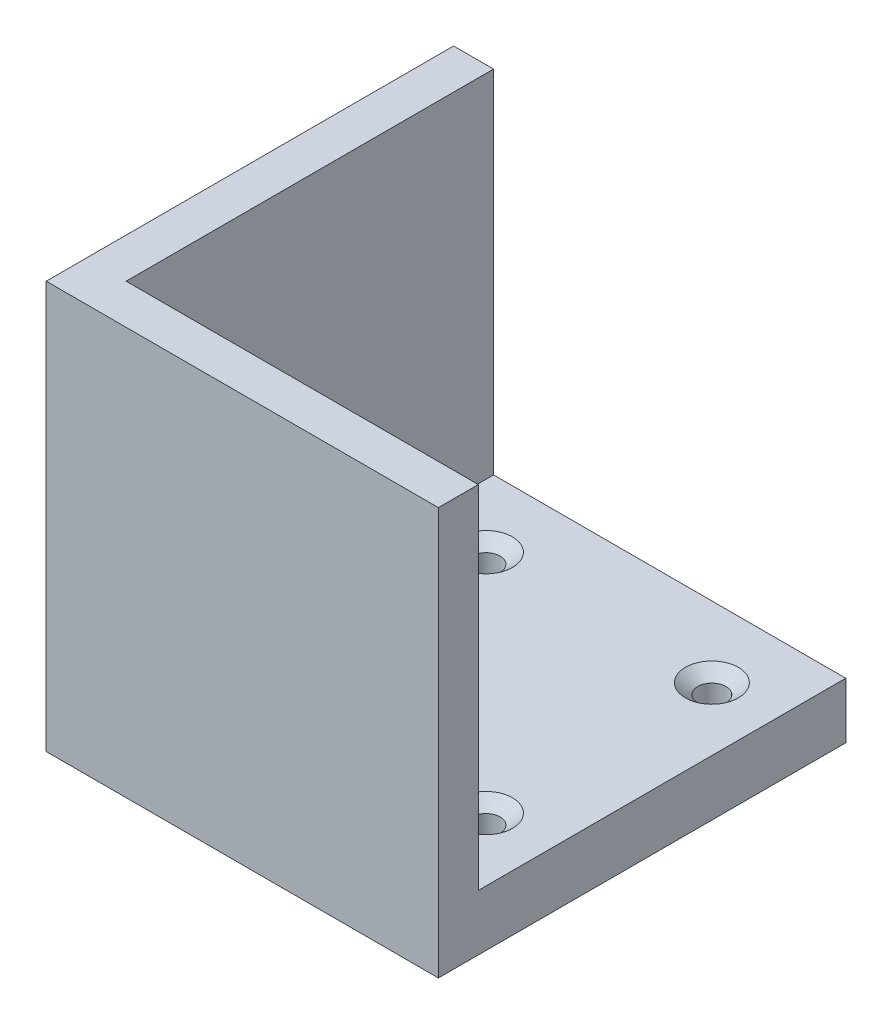
ISO-10303-21;
HEADER;
FILE_DESCRIPTION(('STEP AP214'),'2;1');
FILE_NAME('part.step','',(''),(''),'','','');
FILE_SCHEMA(('AUTOMOTIVE_DESIGN { 1 0 10303 214 1 1 1 1 }'));
ENDSEC;
DATA;
#1=APPLICATION_CONTEXT('core data for automotive mechanical design processes');
#2=APPLICATION_PROTOCOL_DEFINITION('international standard','automotive_design',2000,#1);
#3=PRODUCT_CONTEXT('',#1,'mechanical');
#4=PRODUCT('Part','Part','',(#3));
#5=PRODUCT_RELATED_PRODUCT_CATEGORY('part','',(#4));
#6=PRODUCT_DEFINITION_FORMATION('','',#4);
#7=PRODUCT_DEFINITION_CONTEXT('part definition',#1,'design');
#8=PRODUCT_DEFINITION('design','',#6,#7);
#9=PRODUCT_DEFINITION_SHAPE('','',#8);
#10=(LENGTH_UNIT() NAMED_UNIT(*) SI_UNIT(.MILLI.,.METRE.));
#11=(NAMED_UNIT(*) PLANE_ANGLE_UNIT() SI_UNIT($,.RADIAN.));
#12=(NAMED_UNIT(*) SI_UNIT($,.STERADIAN.) SOLID_ANGLE_UNIT());
#13=UNCERTAINTY_MEASURE_WITH_UNIT(LENGTH_MEASURE(1.E-05),#10,'distance_accuracy_value','');
#14=(GEOMETRIC_REPRESENTATION_CONTEXT(3) GLOBAL_UNCERTAINTY_ASSIGNED_CONTEXT((#13)) GLOBAL_UNIT_ASSIGNED_CONTEXT((#10,
#11,#12)) REPRESENTATION_CONTEXT('',''));
#15=CARTESIAN_POINT('',(0.,0.,0.));
#16=DIRECTION('',(0.,0.,1.));
#17=DIRECTION('',(1.,0.,0.));
#18=AXIS2_PLACEMENT_3D('',#15,#16,#17);
#19=CARTESIAN_POINT('',(28.,8.89,29.21));
#20=DIRECTION('',(-1.,0.,0.));
#21=DIRECTION('',(0.,0.,1.));
#22=AXIS2_PLACEMENT_3D('',#19,#20,#21);
#23=PLANE('',#22);
#24=DIRECTION('',(0.,0.,-1.));
#25=VECTOR('',#24,1.);
#26=CARTESIAN_POINT('',(28.,0.,29.21));
#27=LINE('',#26,#25);
#28=CARTESIAN_POINT('',(28.,0.,35.56));
#29=VERTEX_POINT('',#28);
#30=CARTESIAN_POINT('',(28.,0.,-29.21));
#31=VERTEX_POINT('',#30);
#32=EDGE_CURVE('E121',#29,#31,#27,.T.);
#33=ORIENTED_EDGE('',*,*,#32,.T.);
#34=DIRECTION('',(0.,-1.,0.));
#35=VECTOR('',#34,1.);
#36=CARTESIAN_POINT('',(28.,8.89,-29.21));
#37=LINE('',#36,#35);
#38=CARTESIAN_POINT('',(28.,8.89,-29.21));
#39=VERTEX_POINT('',#38);
#40=EDGE_CURVE('E11',#39,#31,#37,.T.);
#41=ORIENTED_EDGE('',*,*,#40,.F.);
#42=DIRECTION('',(0.,0.,-1.));
#43=VECTOR('',#42,1.);
#44=CARTESIAN_POINT('',(28.,8.89,29.21));
#45=LINE('',#44,#43);
#46=CARTESIAN_POINT('',(28.,8.89,29.21));
#47=VERTEX_POINT('',#46);
#48=EDGE_CURVE('E131',#47,#39,#45,.T.);
#49=ORIENTED_EDGE('',*,*,#48,.F.);
#50=DIRECTION('',(0.,-1.,0.));
#51=VECTOR('',#50,1.);
#52=CARTESIAN_POINT('',(28.,64.77,29.21));
#53=LINE('',#52,#51);
#54=CARTESIAN_POINT('',(28.,64.77,29.21));
#55=VERTEX_POINT('',#54);
#56=EDGE_CURVE('E153',#55,#47,#53,.T.);
#57=ORIENTED_EDGE('',*,*,#56,.F.);
#58=DIRECTION('',(0.,0.,-1.));
#59=VECTOR('',#58,1.);
#60=CARTESIAN_POINT('',(28.,64.77,29.21));
#61=LINE('',#60,#59);
#62=CARTESIAN_POINT('',(28.,64.77,35.56));
#63=VERTEX_POINT('',#62);
#64=EDGE_CURVE('E169',#63,#55,#61,.T.);
#65=ORIENTED_EDGE('',*,*,#64,.F.);
#66=DIRECTION('',(0.,-1.,0.));
#67=VECTOR('',#66,1.);
#68=CARTESIAN_POINT('',(28.,64.77,35.56));
#69=LINE('',#68,#67);
#70=EDGE_CURVE('E127',#63,#29,#69,.T.);
#71=ORIENTED_EDGE('',*,*,#70,.T.);
#72=EDGE_LOOP('',(#33,#41,#49,#57,#65,#71));
#73=FACE_BOUND('',#72,.T.);
#74=ADVANCED_FACE('F39',(#73),#23,.F.);
#75=CARTESIAN_POINT('',(-28.,8.89,-29.21));
#76=DIRECTION('',(0.,0.,1.));
#77=DIRECTION('',(1.,0.,0.));
#78=AXIS2_PLACEMENT_3D('',#75,#76,#77);
#79=PLANE('',#78);
#80=DIRECTION('',(-1.,0.,0.));
#81=VECTOR('',#80,1.);
#82=CARTESIAN_POINT('',(-28.,0.,-29.21));
#83=LINE('',#82,#81);
#84=CARTESIAN_POINT('',(-34.35,0.,-29.21));
#85=VERTEX_POINT('',#84);
#86=EDGE_CURVE('E118',#31,#85,#83,.T.);
#87=ORIENTED_EDGE('',*,*,#86,.T.);
#88=DIRECTION('',(0.,-1.,0.));
#89=VECTOR('',#88,1.);
#90=CARTESIAN_POINT('',(-34.35,64.77,-29.21));
#91=LINE('',#90,#89);
#92=CARTESIAN_POINT('',(-34.35,64.77,-29.21));
#93=VERTEX_POINT('',#92);
#94=EDGE_CURVE('E97',#93,#85,#91,.T.);
#95=ORIENTED_EDGE('',*,*,#94,.F.);
#96=DIRECTION('',(-1.,0.,0.));
#97=VECTOR('',#96,1.);
#98=CARTESIAN_POINT('',(-34.35,64.77,-29.21));
#99=LINE('',#98,#97);
#100=CARTESIAN_POINT('',(-28.,64.77,-29.21));
#101=VERTEX_POINT('',#100);
#102=EDGE_CURVE('E104',#101,#93,#99,.T.);
#103=ORIENTED_EDGE('',*,*,#102,.F.);
#104=DIRECTION('',(0.,-1.,0.));
#105=VECTOR('',#104,1.);
#106=CARTESIAN_POINT('',(-28.,64.77,-29.21));
#107=LINE('',#106,#105);
#108=CARTESIAN_POINT('',(-28.,8.89,-29.21));
#109=VERTEX_POINT('',#108);
#110=EDGE_CURVE('E156',#101,#109,#107,.T.);
#111=ORIENTED_EDGE('',*,*,#110,.T.);
#112=DIRECTION('',(-1.,0.,0.));
#113=VECTOR('',#112,1.);
#114=CARTESIAN_POINT('',(-28.,8.89,-29.21));
#115=LINE('',#114,#113);
#116=EDGE_CURVE('E134',#39,#109,#115,.T.);
#117=ORIENTED_EDGE('',*,*,#116,.F.);
#118=ORIENTED_EDGE('',*,*,#40,.T.);
#119=EDGE_LOOP('',(#87,#95,#103,#111,#117,#118));
#120=FACE_BOUND('',#119,.T.);
#121=ADVANCED_FACE('F116',(#120),#79,.F.);
#122=CARTESIAN_POINT('',(0.,8.89,0.));
#123=DIRECTION('',(0.,-1.,0.));
#124=DIRECTION('',(0.,0.,-1.));
#125=AXIS2_PLACEMENT_3D('',#122,#123,#124);
#126=PLANE('',#125);
#127=CARTESIAN_POINT('',(17.9605122421383,8.89,-17.9605122421382));
#128=DIRECTION('',(0.,1.,0.));
#129=DIRECTION('',(0.,0.,1.));
#130=AXIS2_PLACEMENT_3D('',#127,#128,#129);
#131=CIRCLE('',#130,4.2164);
#132=CARTESIAN_POINT('',(17.9605122421383,8.89,-13.7441122421382));
#133=VERTEX_POINT('',#132);
#134=EDGE_CURVE('E233',#133,#133,#131,.T.);
#135=ORIENTED_EDGE('',*,*,#134,.F.);
#136=EDGE_LOOP('',(#135));
#137=FACE_BOUND('',#136,.T.);
#138=CARTESIAN_POINT('',(17.9605122421383,8.89,17.9605122421383));
#139=DIRECTION('',(0.,1.,0.));
#140=DIRECTION('',(0.,0.,1.));
#141=AXIS2_PLACEMENT_3D('',#138,#139,#140);
#142=CIRCLE('',#141,4.2164);
#143=CARTESIAN_POINT('',(17.9605122421383,8.89,22.1769122421383));
#144=VERTEX_POINT('',#143);
#145=EDGE_CURVE('E221',#144,#144,#142,.T.);
#146=ORIENTED_EDGE('',*,*,#145,.F.);
#147=EDGE_LOOP('',(#146));
#148=FACE_BOUND('',#147,.T.);
#149=CARTESIAN_POINT('',(-17.9605122421383,8.89,17.9605122421383));
#150=DIRECTION('',(0.,1.,0.));
#151=DIRECTION('',(0.,0.,1.));
#152=AXIS2_PLACEMENT_3D('',#149,#150,#151);
#153=CIRCLE('',#152,4.2164);
#154=CARTESIAN_POINT('',(-17.9605122421383,8.89,22.1769122421383));
#155=VERTEX_POINT('',#154);
#156=EDGE_CURVE('E209',#155,#155,#153,.T.);
#157=ORIENTED_EDGE('',*,*,#156,.F.);
#158=EDGE_LOOP('',(#157));
#159=FACE_BOUND('',#158,.T.);
#160=CARTESIAN_POINT('',(-17.9605122421384,8.89,-17.9605122421382));
#161=DIRECTION('',(0.,1.,0.));
#162=DIRECTION('',(0.,0.,1.));
#163=AXIS2_PLACEMENT_3D('',#160,#161,#162);
#164=CIRCLE('',#163,4.2164);
#165=CARTESIAN_POINT('',(-17.9605122421384,8.89,-13.7441122421382));
#166=VERTEX_POINT('',#165);
#167=EDGE_CURVE('E197',#166,#166,#164,.T.);
#168=ORIENTED_EDGE('',*,*,#167,.F.);
#169=EDGE_LOOP('',(#168));
#170=FACE_BOUND('',#169,.T.);
#171=ORIENTED_EDGE('',*,*,#48,.T.);
#172=ORIENTED_EDGE('',*,*,#116,.T.);
#173=DIRECTION('',(0.,0.,1.));
#174=VECTOR('',#173,1.);
#175=CARTESIAN_POINT('',(-28.,8.89,29.21));
#176=LINE('',#175,#174);
#177=CARTESIAN_POINT('',(-28.,8.89,29.21));
#178=VERTEX_POINT('',#177);
#179=EDGE_CURVE('E137',#109,#178,#176,.T.);
#180=ORIENTED_EDGE('',*,*,#179,.T.);
#181=DIRECTION('',(1.,0.,0.));
#182=VECTOR('',#181,1.);
#183=CARTESIAN_POINT('',(-28.,8.89,29.21));
#184=LINE('',#183,#182);
#185=EDGE_CURVE('E48',#178,#47,#184,.T.);
#186=ORIENTED_EDGE('',*,*,#185,.T.);
#187=EDGE_LOOP('',(#171,#172,#180,#186));
#188=FACE_BOUND('',#187,.T.);
#189=ADVANCED_FACE('F143',(#137,#148,#159,#170,#188),#126,.F.);
#190=CARTESIAN_POINT('',(0.,0.,0.));
#191=DIRECTION('',(0.,-1.,0.));
#192=DIRECTION('',(0.,0.,-1.));
#193=AXIS2_PLACEMENT_3D('',#190,#191,#192);
#194=PLANE('',#193);
#195=CARTESIAN_POINT('',(17.9605122421383,0.,-17.9605122421382));
#196=DIRECTION('',(0.,1.,0.));
#197=DIRECTION('',(0.,0.,1.));
#198=AXIS2_PLACEMENT_3D('',#195,#196,#197);
#199=CIRCLE('',#198,2.2479);
#200=CARTESIAN_POINT('',(17.9605122421383,0.,-15.7126122421382));
#201=VERTEX_POINT('',#200);
#202=EDGE_CURVE('E225',#201,#201,#199,.T.);
#203=ORIENTED_EDGE('',*,*,#202,.T.);
#204=EDGE_LOOP('',(#203));
#205=FACE_BOUND('',#204,.T.);
#206=CARTESIAN_POINT('',(17.9605122421383,0.,17.9605122421383));
#207=DIRECTION('',(0.,1.,0.));
#208=DIRECTION('',(0.,0.,1.));
#209=AXIS2_PLACEMENT_3D('',#206,#207,#208);
#210=CIRCLE('',#209,2.2479);
#211=CARTESIAN_POINT('',(17.9605122421383,0.,20.2084122421383));
#212=VERTEX_POINT('',#211);
#213=EDGE_CURVE('E213',#212,#212,#210,.T.);
#214=ORIENTED_EDGE('',*,*,#213,.T.);
#215=EDGE_LOOP('',(#214));
#216=FACE_BOUND('',#215,.T.);
#217=CARTESIAN_POINT('',(-17.9605122421383,0.,17.9605122421383));
#218=DIRECTION('',(0.,1.,0.));
#219=DIRECTION('',(0.,0.,1.));
#220=AXIS2_PLACEMENT_3D('',#217,#218,#219);
#221=CIRCLE('',#220,2.2479);
#222=CARTESIAN_POINT('',(-17.9605122421383,0.,20.2084122421383));
#223=VERTEX_POINT('',#222);
#224=EDGE_CURVE('E201',#223,#223,#221,.T.);
#225=ORIENTED_EDGE('',*,*,#224,.T.);
#226=EDGE_LOOP('',(#225));
#227=FACE_BOUND('',#226,.T.);
#228=CARTESIAN_POINT('',(-17.9605122421384,0.,-17.9605122421382));
#229=DIRECTION('',(0.,1.,0.));
#230=DIRECTION('',(0.,0.,1.));
#231=AXIS2_PLACEMENT_3D('',#228,#229,#230);
#232=CIRCLE('',#231,2.2479);
#233=CARTESIAN_POINT('',(-17.9605122421384,0.,-15.7126122421382));
#234=VERTEX_POINT('',#233);
#235=EDGE_CURVE('E178',#234,#234,#232,.T.);
#236=ORIENTED_EDGE('',*,*,#235,.T.);
#237=EDGE_LOOP('',(#236));
#238=FACE_BOUND('',#237,.T.);
#239=ORIENTED_EDGE('',*,*,#32,.F.);
#240=DIRECTION('',(1.,0.,0.));
#241=VECTOR('',#240,1.);
#242=CARTESIAN_POINT('',(-34.35,0.,35.56));
#243=LINE('',#242,#241);
#244=CARTESIAN_POINT('',(-34.35,0.,35.56));
#245=VERTEX_POINT('',#244);
#246=EDGE_CURVE('E114',#245,#29,#243,.T.);
#247=ORIENTED_EDGE('',*,*,#246,.F.);
#248=DIRECTION('',(0.,0.,1.));
#249=VECTOR('',#248,1.);
#250=CARTESIAN_POINT('',(-34.35,0.,-29.21));
#251=LINE('',#250,#249);
#252=EDGE_CURVE('E176',#85,#245,#251,.T.);
#253=ORIENTED_EDGE('',*,*,#252,.F.);
#254=ORIENTED_EDGE('',*,*,#86,.F.);
#255=EDGE_LOOP('',(#239,#247,#253,#254));
#256=FACE_BOUND('',#255,.T.);
#257=ADVANCED_FACE('F242',(#205,#216,#227,#238,#256),#194,.T.);
#258=CARTESIAN_POINT('',(-28.,64.77,29.21));
#259=DIRECTION('',(0.,0.,1.));
#260=DIRECTION('',(1.,0.,0.));
#261=AXIS2_PLACEMENT_3D('',#258,#259,#260);
#262=PLANE('',#261);
#263=ORIENTED_EDGE('',*,*,#56,.T.);
#264=ORIENTED_EDGE('',*,*,#185,.F.);
#265=DIRECTION('',(0.,-1.,0.));
#266=VECTOR('',#265,1.);
#267=CARTESIAN_POINT('',(-28.,64.77,29.21));
#268=LINE('',#267,#266);
#269=CARTESIAN_POINT('',(-28.,64.77,29.21));
#270=VERTEX_POINT('',#269);
#271=EDGE_CURVE('E151',#270,#178,#268,.T.);
#272=ORIENTED_EDGE('',*,*,#271,.F.);
#273=DIRECTION('',(-1.,0.,0.));
#274=VECTOR('',#273,1.);
#275=CARTESIAN_POINT('',(-28.,64.77,29.21));
#276=LINE('',#275,#274);
#277=EDGE_CURVE('E183',#55,#270,#276,.T.);
#278=ORIENTED_EDGE('',*,*,#277,.F.);
#279=EDGE_LOOP('',(#263,#264,#272,#278));
#280=FACE_BOUND('',#279,.T.);
#281=ADVANCED_FACE('F149',(#280),#262,.F.);
#282=CARTESIAN_POINT('',(-28.,64.77,-29.21));
#283=DIRECTION('',(-1.,0.,0.));
#284=DIRECTION('',(0.,0.,1.));
#285=AXIS2_PLACEMENT_3D('',#282,#283,#284);
#286=PLANE('',#285);
#287=ORIENTED_EDGE('',*,*,#271,.T.);
#288=ORIENTED_EDGE('',*,*,#179,.F.);
#289=ORIENTED_EDGE('',*,*,#110,.F.);
#290=DIRECTION('',(0.,0.,-1.));
#291=VECTOR('',#290,1.);
#292=CARTESIAN_POINT('',(-28.,64.77,-29.21));
#293=LINE('',#292,#291);
#294=EDGE_CURVE('E109',#270,#101,#293,.T.);
#295=ORIENTED_EDGE('',*,*,#294,.F.);
#296=EDGE_LOOP('',(#287,#288,#289,#295));
#297=FACE_BOUND('',#296,.T.);
#298=ADVANCED_FACE('F154',(#297),#286,.F.);
#299=CARTESIAN_POINT('',(-34.35,64.77,-29.21));
#300=DIRECTION('',(1.,0.,0.));
#301=DIRECTION('',(0.,0.,-1.));
#302=AXIS2_PLACEMENT_3D('',#299,#300,#301);
#303=PLANE('',#302);
#304=ORIENTED_EDGE('',*,*,#252,.T.);
#305=DIRECTION('',(0.,-1.,0.));
#306=VECTOR('',#305,1.);
#307=CARTESIAN_POINT('',(-34.35,64.77,35.56));
#308=LINE('',#307,#306);
#309=CARTESIAN_POINT('',(-34.35,64.77,35.56));
#310=VERTEX_POINT('',#309);
#311=EDGE_CURVE('E99',#310,#245,#308,.T.);
#312=ORIENTED_EDGE('',*,*,#311,.F.);
#313=DIRECTION('',(0.,0.,1.));
#314=VECTOR('',#313,1.);
#315=CARTESIAN_POINT('',(-34.35,64.77,-29.21));
#316=LINE('',#315,#314);
#317=EDGE_CURVE('E93',#93,#310,#316,.T.);
#318=ORIENTED_EDGE('',*,*,#317,.F.);
#319=ORIENTED_EDGE('',*,*,#94,.T.);
#320=EDGE_LOOP('',(#304,#312,#318,#319));
#321=FACE_BOUND('',#320,.T.);
#322=ADVANCED_FACE('F95',(#321),#303,.F.);
#323=CARTESIAN_POINT('',(-34.35,64.77,35.56));
#324=DIRECTION('',(0.,0.,-1.));
#325=DIRECTION('',(-1.,0.,0.));
#326=AXIS2_PLACEMENT_3D('',#323,#324,#325);
#327=PLANE('',#326);
#328=ORIENTED_EDGE('',*,*,#246,.T.);
#329=ORIENTED_EDGE('',*,*,#70,.F.);
#330=DIRECTION('',(1.,0.,0.));
#331=VECTOR('',#330,1.);
#332=CARTESIAN_POINT('',(-34.35,64.77,35.56));
#333=LINE('',#332,#331);
#334=EDGE_CURVE('E103',#310,#63,#333,.T.);
#335=ORIENTED_EDGE('',*,*,#334,.F.);
#336=ORIENTED_EDGE('',*,*,#311,.T.);
#337=EDGE_LOOP('',(#328,#329,#335,#336));
#338=FACE_BOUND('',#337,.T.);
#339=ADVANCED_FACE('F172',(#338),#327,.F.);
#340=CARTESIAN_POINT('',(0.,64.77,0.));
#341=DIRECTION('',(0.,-1.,0.));
#342=DIRECTION('',(0.,0.,-1.));
#343=AXIS2_PLACEMENT_3D('',#340,#341,#342);
#344=PLANE('',#343);
#345=ORIENTED_EDGE('',*,*,#102,.T.);
#346=ORIENTED_EDGE('',*,*,#317,.T.);
#347=ORIENTED_EDGE('',*,*,#334,.T.);
#348=ORIENTED_EDGE('',*,*,#64,.T.);
#349=ORIENTED_EDGE('',*,*,#277,.T.);
#350=ORIENTED_EDGE('',*,*,#294,.T.);
#351=EDGE_LOOP('',(#345,#346,#347,#348,#349,#350));
#352=FACE_BOUND('',#351,.T.);
#353=ADVANCED_FACE('F107',(#352),#344,.F.);
#354=CARTESIAN_POINT('',(-17.9605122421384,8.89,-17.9605122421382));
#355=DIRECTION('',(0.,1.,0.));
#356=DIRECTION('',(0.,0.,1.));
#357=AXIS2_PLACEMENT_3D('',#354,#355,#356);
#358=CYLINDRICAL_SURFACE('',#357,2.2479);
#359=ORIENTED_EDGE('',*,*,#235,.F.);
#360=EDGE_LOOP('',(#359));
#361=FACE_BOUND('',#360,.T.);
#362=CARTESIAN_POINT('',(-17.9605122421384,7.23823237602752,-17.9605122421382));
#363=DIRECTION('',(0.,1.,0.));
#364=DIRECTION('',(0.,0.,1.));
#365=AXIS2_PLACEMENT_3D('',#362,#363,#364);
#366=CIRCLE('',#365,2.2479);
#367=CARTESIAN_POINT('',(-17.9605122421384,7.23823237602752,-15.7126122421382));
#368=VERTEX_POINT('',#367);
#369=EDGE_CURVE('E193',#368,#368,#366,.T.);
#370=ORIENTED_EDGE('',*,*,#369,.T.);
#371=EDGE_LOOP('',(#370));
#372=FACE_BOUND('',#371,.T.);
#373=ADVANCED_FACE('F253',(#361,#372),#358,.F.);
#374=CARTESIAN_POINT('',(-17.9605122421384,8.89,-17.9605122421382));
#375=DIRECTION('',(0.,1.,0.));
#376=DIRECTION('',(0.,0.,1.));
#377=AXIS2_PLACEMENT_3D('',#374,#375,#376);
#378=CONICAL_SURFACE('',#377,4.2164,0.872664625997165);
#379=ORIENTED_EDGE('',*,*,#369,.F.);
#380=EDGE_LOOP('',(#379));
#381=FACE_BOUND('',#380,.T.);
#382=ORIENTED_EDGE('',*,*,#167,.T.);
#383=EDGE_LOOP('',(#382));
#384=FACE_BOUND('',#383,.T.);
#385=ADVANCED_FACE('F250',(#381,#384),#378,.F.);
#386=CARTESIAN_POINT('',(-17.9605122421383,8.89,17.9605122421383));
#387=DIRECTION('',(0.,1.,0.));
#388=DIRECTION('',(0.,0.,1.));
#389=AXIS2_PLACEMENT_3D('',#386,#387,#388);
#390=CYLINDRICAL_SURFACE('',#389,2.2479);
#391=ORIENTED_EDGE('',*,*,#224,.F.);
#392=EDGE_LOOP('',(#391));
#393=FACE_BOUND('',#392,.T.);
#394=CARTESIAN_POINT('',(-17.9605122421383,7.23823237602752,17.9605122421383));
#395=DIRECTION('',(0.,1.,0.));
#396=DIRECTION('',(0.,0.,1.));
#397=AXIS2_PLACEMENT_3D('',#394,#395,#396);
#398=CIRCLE('',#397,2.2479);
#399=CARTESIAN_POINT('',(-17.9605122421383,7.23823237602752,20.2084122421383));
#400=VERTEX_POINT('',#399);
#401=EDGE_CURVE('E205',#400,#400,#398,.T.);
#402=ORIENTED_EDGE('',*,*,#401,.T.);
#403=EDGE_LOOP('',(#402));
#404=FACE_BOUND('',#403,.T.);
#405=ADVANCED_FACE('F252',(#393,#404),#390,.F.);
#406=CARTESIAN_POINT('',(-17.9605122421383,8.89,17.9605122421383));
#407=DIRECTION('',(0.,1.,0.));
#408=DIRECTION('',(0.,0.,1.));
#409=AXIS2_PLACEMENT_3D('',#406,#407,#408);
#410=CONICAL_SURFACE('',#409,4.2164,0.872664625997165);
#411=ORIENTED_EDGE('',*,*,#401,.F.);
#412=EDGE_LOOP('',(#411));
#413=FACE_BOUND('',#412,.T.);
#414=ORIENTED_EDGE('',*,*,#156,.T.);
#415=EDGE_LOOP('',(#414));
#416=FACE_BOUND('',#415,.T.);
#417=ADVANCED_FACE('F260',(#413,#416),#410,.F.);
#418=CARTESIAN_POINT('',(17.9605122421383,8.89,17.9605122421383));
#419=DIRECTION('',(0.,1.,0.));
#420=DIRECTION('',(0.,0.,1.));
#421=AXIS2_PLACEMENT_3D('',#418,#419,#420);
#422=CYLINDRICAL_SURFACE('',#421,2.2479);
#423=ORIENTED_EDGE('',*,*,#213,.F.);
#424=EDGE_LOOP('',(#423));
#425=FACE_BOUND('',#424,.T.);
#426=CARTESIAN_POINT('',(17.9605122421383,7.23823237602752,17.9605122421383));
#427=DIRECTION('',(0.,1.,0.));
#428=DIRECTION('',(0.,0.,1.));
#429=AXIS2_PLACEMENT_3D('',#426,#427,#428);
#430=CIRCLE('',#429,2.2479);
#431=CARTESIAN_POINT('',(17.9605122421383,7.23823237602752,20.2084122421383));
#432=VERTEX_POINT('',#431);
#433=EDGE_CURVE('E217',#432,#432,#430,.T.);
#434=ORIENTED_EDGE('',*,*,#433,.T.);
#435=EDGE_LOOP('',(#434));
#436=FACE_BOUND('',#435,.T.);
#437=ADVANCED_FACE('F316',(#425,#436),#422,.F.);
#438=CARTESIAN_POINT('',(17.9605122421383,8.89,17.9605122421383));
#439=DIRECTION('',(0.,1.,0.));
#440=DIRECTION('',(0.,0.,1.));
#441=AXIS2_PLACEMENT_3D('',#438,#439,#440);
#442=CONICAL_SURFACE('',#441,4.2164,0.872664625997165);
#443=ORIENTED_EDGE('',*,*,#433,.F.);
#444=EDGE_LOOP('',(#443));
#445=FACE_BOUND('',#444,.T.);
#446=ORIENTED_EDGE('',*,*,#145,.T.);
#447=EDGE_LOOP('',(#446));
#448=FACE_BOUND('',#447,.T.);
#449=ADVANCED_FACE('F326',(#445,#448),#442,.F.);
#450=CARTESIAN_POINT('',(17.9605122421383,8.89,-17.9605122421382));
#451=DIRECTION('',(0.,1.,0.));
#452=DIRECTION('',(0.,0.,1.));
#453=AXIS2_PLACEMENT_3D('',#450,#451,#452);
#454=CYLINDRICAL_SURFACE('',#453,2.2479);
#455=ORIENTED_EDGE('',*,*,#202,.F.);
#456=EDGE_LOOP('',(#455));
#457=FACE_BOUND('',#456,.T.);
#458=CARTESIAN_POINT('',(17.9605122421383,7.23823237602752,-17.9605122421382));
#459=DIRECTION('',(0.,1.,0.));
#460=DIRECTION('',(0.,0.,1.));
#461=AXIS2_PLACEMENT_3D('',#458,#459,#460);
#462=CIRCLE('',#461,2.2479);
#463=CARTESIAN_POINT('',(17.9605122421383,7.23823237602752,-15.7126122421382));
#464=VERTEX_POINT('',#463);
#465=EDGE_CURVE('E229',#464,#464,#462,.T.);
#466=ORIENTED_EDGE('',*,*,#465,.T.);
#467=EDGE_LOOP('',(#466));
#468=FACE_BOUND('',#467,.T.);
#469=ADVANCED_FACE('F336',(#457,#468),#454,.F.);
#470=CARTESIAN_POINT('',(17.9605122421383,8.89,-17.9605122421382));
#471=DIRECTION('',(0.,1.,0.));
#472=DIRECTION('',(0.,0.,1.));
#473=AXIS2_PLACEMENT_3D('',#470,#471,#472);
#474=CONICAL_SURFACE('',#473,4.2164,0.872664625997166);
#475=ORIENTED_EDGE('',*,*,#465,.F.);
#476=EDGE_LOOP('',(#475));
#477=FACE_BOUND('',#476,.T.);
#478=ORIENTED_EDGE('',*,*,#134,.T.);
#479=EDGE_LOOP('',(#478));
#480=FACE_BOUND('',#479,.T.);
#481=ADVANCED_FACE('F238',(#477,#480),#474,.F.);
#482=CLOSED_SHELL('',(#74,#121,#189,#257,#281,#298,#322,#339,#353,#373,#385,#405,#417,#437,#449,
#469,#481));
#483=MANIFOLD_SOLID_BREP('B2',#482);
#484=ADVANCED_BREP_SHAPE_REPRESENTATION('',(#18,#483),#14);
#485=SHAPE_DEFINITION_REPRESENTATION(#9,#484);
ENDSEC;
END-ISO-10303-21;
